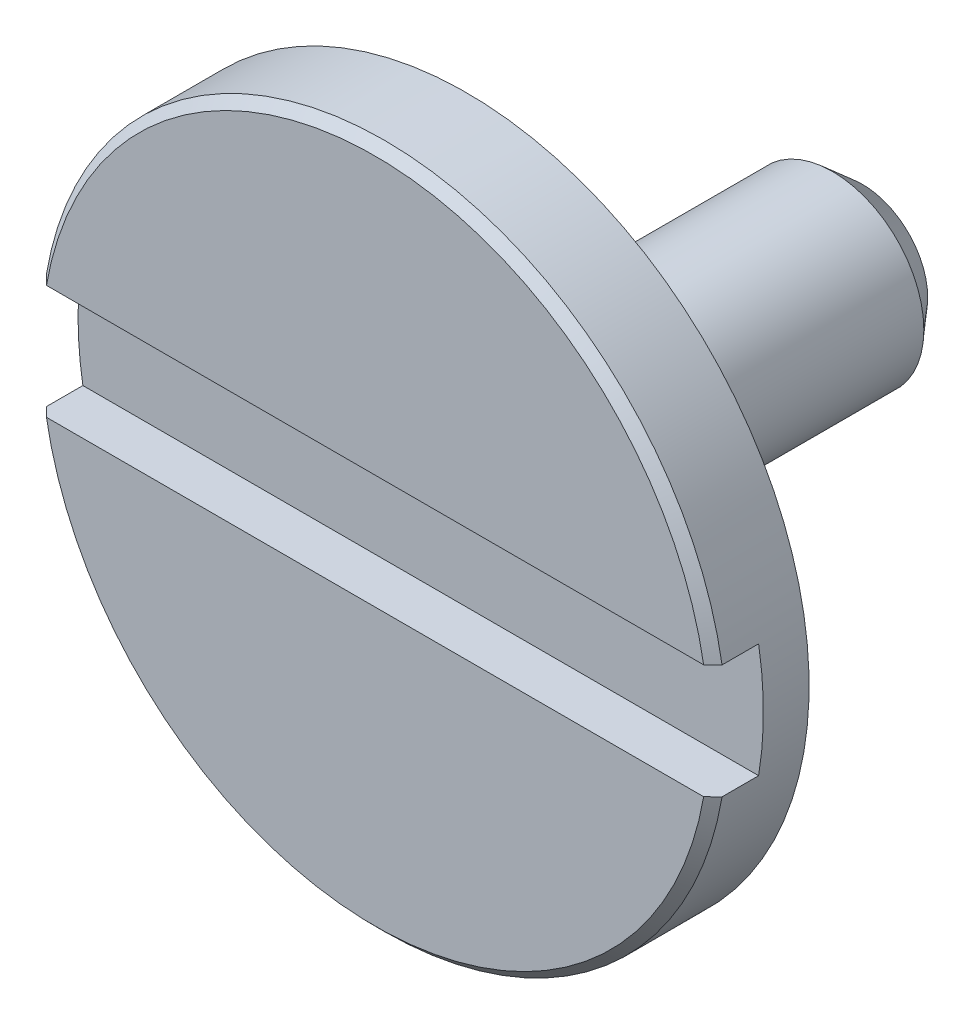
ISO-10303-21;
HEADER;
FILE_DESCRIPTION(('STEP AP214'),'2;1');
FILE_NAME('part.step','',(''),(''),'','','');
FILE_SCHEMA(('AUTOMOTIVE_DESIGN { 1 0 10303 214 1 1 1 1 }'));
ENDSEC;
DATA;
#1=APPLICATION_CONTEXT('core data for automotive mechanical design processes');
#2=APPLICATION_PROTOCOL_DEFINITION('international standard','automotive_design',2000,#1);
#3=PRODUCT_CONTEXT('',#1,'mechanical');
#4=PRODUCT('Part','Part','',(#3));
#5=PRODUCT_RELATED_PRODUCT_CATEGORY('part','',(#4));
#6=PRODUCT_DEFINITION_FORMATION('','',#4);
#7=PRODUCT_DEFINITION_CONTEXT('part definition',#1,'design');
#8=PRODUCT_DEFINITION('design','',#6,#7);
#9=PRODUCT_DEFINITION_SHAPE('','',#8);
#10=(LENGTH_UNIT() NAMED_UNIT(*) SI_UNIT(.MILLI.,.METRE.));
#11=(NAMED_UNIT(*) PLANE_ANGLE_UNIT() SI_UNIT($,.RADIAN.));
#12=(NAMED_UNIT(*) SI_UNIT($,.STERADIAN.) SOLID_ANGLE_UNIT());
#13=UNCERTAINTY_MEASURE_WITH_UNIT(LENGTH_MEASURE(1.E-05),#10,'distance_accuracy_value','');
#14=(GEOMETRIC_REPRESENTATION_CONTEXT(3) GLOBAL_UNCERTAINTY_ASSIGNED_CONTEXT((#13)) GLOBAL_UNIT_ASSIGNED_CONTEXT((#10,
#11,#12)) REPRESENTATION_CONTEXT('',''));
#15=CARTESIAN_POINT('',(0.,0.,0.));
#16=DIRECTION('',(0.,0.,1.));
#17=DIRECTION('',(1.,0.,0.));
#18=AXIS2_PLACEMENT_3D('',#15,#16,#17);
#19=CARTESIAN_POINT('',(-32.1280399999999,18.1449999999788,14.9608354648813));
#20=DIRECTION('',(0.,0.,-1.));
#21=DIRECTION('',(-1.,0.,0.));
#22=AXIS2_PLACEMENT_3D('',#19,#20,#21);
#23=PLANE('',#22);
#24=DIRECTION('',(1.,0.,0.));
#25=VECTOR('',#24,1.);
#26=CARTESIAN_POINT('',(-33.9799999999999,18.1449999999788,14.9608354648813));
#27=LINE('',#26,#25);
#28=CARTESIAN_POINT('',(-35.7844043338606,18.1449999999788,14.9608354649789));
#29=VERTEX_POINT('',#28);
#30=CARTESIAN_POINT('',(-32.1755956661392,18.1449999999788,14.9608354649789));
#31=VERTEX_POINT('',#30);
#32=EDGE_CURVE('E91',#29,#31,#27,.T.);
#33=ORIENTED_EDGE('',*,*,#32,.T.);
#34=CARTESIAN_POINT('',(-33.9799999999999,18.4499999999788,14.9608354650765));
#35=DIRECTION('',(0.,0.,-1.));
#36=DIRECTION('',(-1.,0.,0.));
#37=AXIS2_PLACEMENT_3D('',#34,#35,#36);
#38=CIRCLE('',#37,1.83);
#39=CARTESIAN_POINT('',(-32.1755956661392,18.7549999999788,14.9608354649789));
#40=VERTEX_POINT('',#39);
#41=EDGE_CURVE('E38',#40,#31,#38,.T.);
#42=ORIENTED_EDGE('',*,*,#41,.F.);
#43=DIRECTION('',(-1.,0.,0.));
#44=VECTOR('',#43,1.);
#45=CARTESIAN_POINT('',(-33.9799999999999,18.7549999999788,14.9608354648813));
#46=LINE('',#45,#44);
#47=CARTESIAN_POINT('',(-35.7844043338606,18.7549999999788,14.9608354649789));
#48=VERTEX_POINT('',#47);
#49=EDGE_CURVE('E88',#40,#48,#46,.T.);
#50=ORIENTED_EDGE('',*,*,#49,.T.);
#51=CARTESIAN_POINT('',(-33.9799999999999,18.4499999999788,14.9608354650765));
#52=DIRECTION('',(0.,0.,-1.));
#53=DIRECTION('',(-1.,0.,0.));
#54=AXIS2_PLACEMENT_3D('',#51,#52,#53);
#55=CIRCLE('',#54,1.83);
#56=EDGE_CURVE('E94',#29,#48,#55,.T.);
#57=ORIENTED_EDGE('',*,*,#56,.F.);
#58=EDGE_LOOP('',(#33,#42,#50,#57));
#59=FACE_BOUND('',#58,.T.);
#60=ADVANCED_FACE('F34',(#59),#23,.F.);
#61=CARTESIAN_POINT('',(-35.7844043338759,18.7549999999788,14.9608354648813));
#62=DIRECTION('',(0.,1.,0.));
#63=DIRECTION('',(0.,0.,1.));
#64=AXIS2_PLACEMENT_3D('',#61,#62,#63);
#65=PLANE('',#64);
#66=DIRECTION('',(0.,0.,-1.));
#67=VECTOR('',#66,1.);
#68=CARTESIAN_POINT('',(-32.1755956661239,18.7549999999788,15.0828354648813));
#69=LINE('',#68,#67);
#70=CARTESIAN_POINT('',(-32.1755956661357,18.7549999999788,15.1560354648779));
#71=VERTEX_POINT('',#70);
#72=EDGE_CURVE('E97',#71,#40,#69,.T.);
#73=ORIENTED_EDGE('',*,*,#72,.F.);
#74=CARTESIAN_POINT('',(-32.2251072857969,18.7549999999788,15.204835465341));
#75=CARTESIAN_POINT('',(-32.2168537349249,18.7549999999788,15.1967037697313));
#76=CARTESIAN_POINT('',(-32.2086009911842,18.7549999999788,15.1885712552204));
#77=CARTESIAN_POINT('',(-32.1920971179678,18.7549999999788,15.1723045883982));
#78=CARTESIAN_POINT('',(-32.183845988492,18.7549999999788,15.164170436087));
#79=CARTESIAN_POINT('',(-32.1755956661475,18.7549999999788,15.1560354648745));
#80=B_SPLINE_CURVE_WITH_KNOTS('',3,(#74,#75,#76,#77,#78,#79),.UNSPECIFIED.,.F.,.F.,(4,2,4),(0.,
0.0347593173649959,0.0695186347207362),.UNSPECIFIED.);
#81=CARTESIAN_POINT('',(-32.2251072855637,18.7549999999788,15.2048354651112));
#82=VERTEX_POINT('',#81);
#83=EDGE_CURVE('E104',#82,#71,#80,.T.);
#84=ORIENTED_EDGE('',*,*,#83,.F.);
#85=DIRECTION('',(1.,0.,0.));
#86=VECTOR('',#85,1.);
#87=CARTESIAN_POINT('',(-33.9799999999999,18.7549999999788,15.2048354648813));
#88=LINE('',#87,#86);
#89=CARTESIAN_POINT('',(-35.7348927144297,18.7549999999788,15.2048354651174));
#90=VERTEX_POINT('',#89);
#91=EDGE_CURVE('E193',#90,#82,#88,.T.);
#92=ORIENTED_EDGE('',*,*,#91,.F.);
#93=CARTESIAN_POINT('',(-35.7844043338376,18.7549999999342,15.1560354648333));
#94=CARTESIAN_POINT('',(-35.7761540115027,18.7549999999565,15.1641704360641));
#95=CARTESIAN_POINT('',(-35.7679028820319,18.7549999999713,15.172304588389));
#96=CARTESIAN_POINT('',(-35.7513990088161,18.7549999999862,15.188571255229));
#97=CARTESIAN_POINT('',(-35.7431462650711,18.7549999999862,15.1967037697442));
#98=CARTESIAN_POINT('',(-35.7348927141901,18.7549999999788,15.2048354653535));
#99=B_SPLINE_CURVE_WITH_KNOTS('',3,(#93,#94,#95,#96,#97,#98),.UNSPECIFIED.,.F.,.F.,(4,2,4),(0.,
0.0347593173738836,0.0695186347570097),.UNSPECIFIED.);
#100=CARTESIAN_POINT('',(-35.7844043338606,18.7549999999788,15.1560354648662));
#101=VERTEX_POINT('',#100);
#102=EDGE_CURVE('E116',#101,#90,#99,.T.);
#103=ORIENTED_EDGE('',*,*,#102,.F.);
#104=DIRECTION('',(0.,0.,1.));
#105=VECTOR('',#104,1.);
#106=CARTESIAN_POINT('',(-35.7844043338759,18.7549999999788,15.0828354648813));
#107=LINE('',#106,#105);
#108=EDGE_CURVE('E108',#48,#101,#107,.T.);
#109=ORIENTED_EDGE('',*,*,#108,.F.);
#110=ORIENTED_EDGE('',*,*,#49,.F.);
#111=EDGE_LOOP('',(#73,#84,#92,#103,#109,#110));
#112=FACE_BOUND('',#111,.T.);
#113=ADVANCED_FACE('F106',(#112),#65,.F.);
#114=CARTESIAN_POINT('',(-35.7844043338759,18.1449999999788,15.2048354648813));
#115=DIRECTION('',(0.,-1.,0.));
#116=DIRECTION('',(0.,0.,-1.));
#117=AXIS2_PLACEMENT_3D('',#114,#115,#116);
#118=PLANE('',#117);
#119=DIRECTION('',(0.,0.,-1.));
#120=VECTOR('',#119,1.);
#121=CARTESIAN_POINT('',(-35.7844043338759,18.1449999999788,15.0828354648813));
#122=LINE('',#121,#120);
#123=CARTESIAN_POINT('',(-35.7844043338667,18.1449999999788,15.1560354648753));
#124=VERTEX_POINT('',#123);
#125=EDGE_CURVE('E138',#124,#29,#122,.T.);
#126=ORIENTED_EDGE('',*,*,#125,.F.);
#127=CARTESIAN_POINT('',(-35.7348927140778,18.1450000001504,15.2048354652507));
#128=CARTESIAN_POINT('',(-35.7431462650071,18.1450000000646,15.1967037696913));
#129=CARTESIAN_POINT('',(-35.7513990087873,18.1450000000074,15.1885712552126));
#130=CARTESIAN_POINT('',(-35.7679028820472,18.1449999999502,15.1723045884188));
#131=CARTESIAN_POINT('',(-35.7761540115269,18.1449999999502,15.1641704361037));
#132=CARTESIAN_POINT('',(-35.7844043338575,18.1449999999788,15.1560354648693));
#133=B_SPLINE_CURVE_WITH_KNOTS('',3,(#127,#128,#129,#130,#131,#132),.UNSPECIFIED.,.F.,.F.,(4,2,
4),(0.,0.0347593173815172,0.0695186347537757),.UNSPECIFIED.);
#134=CARTESIAN_POINT('',(-35.7348927144269,18.1449999999788,15.2048354651202));
#135=VERTEX_POINT('',#134);
#136=EDGE_CURVE('E53',#135,#124,#133,.T.);
#137=ORIENTED_EDGE('',*,*,#136,.F.);
#138=DIRECTION('',(-1.,0.,0.));
#139=VECTOR('',#138,1.);
#140=CARTESIAN_POINT('',(-33.9799999999999,18.1449999999788,15.2048354648813));
#141=LINE('',#140,#139);
#142=CARTESIAN_POINT('',(-32.2251072855764,18.1449999999788,15.2048354651237));
#143=VERTEX_POINT('',#142);
#144=EDGE_CURVE('E131',#143,#135,#141,.T.);
#145=ORIENTED_EDGE('',*,*,#144,.F.);
#146=CARTESIAN_POINT('',(-32.1755956661502,18.1449999999788,15.1560354648771));
#147=CARTESIAN_POINT('',(-32.1838459884984,18.1449999999788,15.1641704360933));
#148=CARTESIAN_POINT('',(-32.192097117978,18.1449999999788,15.1723045884083));
#149=CARTESIAN_POINT('',(-32.208600991202,18.1449999999788,15.1885712552379));
#150=CARTESIAN_POINT('',(-32.2168537349465,18.1449999999788,15.1967037697526));
#151=CARTESIAN_POINT('',(-32.2251072858223,18.1449999999788,15.204835465366));
#152=B_SPLINE_CURVE_WITH_KNOTS('',3,(#146,#147,#148,#149,#150,#151),.UNSPECIFIED.,.F.,.F.,(4,2,
4),(0.,0.0347593173716686,0.0695186347525891),.UNSPECIFIED.);
#153=CARTESIAN_POINT('',(-32.1755956661392,18.1449999999788,15.1560354648662));
#154=VERTEX_POINT('',#153);
#155=EDGE_CURVE('E111',#154,#143,#152,.T.);
#156=ORIENTED_EDGE('',*,*,#155,.F.);
#157=DIRECTION('',(0.,0.,1.));
#158=VECTOR('',#157,1.);
#159=CARTESIAN_POINT('',(-32.1755956661239,18.1449999999788,15.0828354648813));
#160=LINE('',#159,#158);
#161=EDGE_CURVE('E109',#31,#154,#160,.T.);
#162=ORIENTED_EDGE('',*,*,#161,.F.);
#163=ORIENTED_EDGE('',*,*,#32,.F.);
#164=EDGE_LOOP('',(#126,#137,#145,#156,#162,#163));
#165=FACE_BOUND('',#164,.T.);
#166=ADVANCED_FACE('F147',(#165),#118,.F.);
#167=CARTESIAN_POINT('',(-35.7559514272639,18.7549999999788,15.2048354648813));
#168=DIRECTION('',(0.,0.,1.));
#169=DIRECTION('',(1.,0.,0.));
#170=AXIS2_PLACEMENT_3D('',#167,#168,#169);
#171=PLANE('',#170);
#172=ORIENTED_EDGE('',*,*,#91,.T.);
#173=CARTESIAN_POINT('',(-33.9799999999999,18.4499999999788,15.2048354648813));
#174=DIRECTION('',(0.,0.,-1.));
#175=DIRECTION('',(-1.,0.,0.));
#176=AXIS2_PLACEMENT_3D('',#173,#174,#175);
#177=CIRCLE('',#176,1.7812);
#178=EDGE_CURVE('E128',#82,#90,#177,.F.);
#179=ORIENTED_EDGE('',*,*,#178,.T.);
#180=EDGE_LOOP('',(#172,#179));
#181=FACE_BOUND('',#180,.T.);
#182=ADVANCED_FACE('F152',(#181),#171,.T.);
#183=CARTESIAN_POINT('',(-35.7559514272639,16.6599427999788,15.2048354648813));
#184=DIRECTION('',(0.,0.,1.));
#185=DIRECTION('',(1.,0.,0.));
#186=AXIS2_PLACEMENT_3D('',#183,#184,#185);
#187=PLANE('',#186);
#188=ORIENTED_EDGE('',*,*,#144,.T.);
#189=CARTESIAN_POINT('',(-33.9799999999999,18.4499999999788,15.2048354648813));
#190=DIRECTION('',(0.,0.,-1.));
#191=DIRECTION('',(-1.,0.,0.));
#192=AXIS2_PLACEMENT_3D('',#189,#190,#191);
#193=CIRCLE('',#192,1.7812);
#194=EDGE_CURVE('E118',#135,#143,#193,.F.);
#195=ORIENTED_EDGE('',*,*,#194,.T.);
#196=EDGE_LOOP('',(#188,#195));
#197=FACE_BOUND('',#196,.T.);
#198=ADVANCED_FACE('F158',(#197),#187,.T.);
#199=CARTESIAN_POINT('',(-33.9799999999999,18.4499999999788,15.2048354648813));
#200=DIRECTION('',(0.,0.,-1.));
#201=DIRECTION('',(-1.,0.,0.));
#202=AXIS2_PLACEMENT_3D('',#199,#200,#201);
#203=CONICAL_SURFACE('',#202,1.7812,0.785398163397431);
#204=ORIENTED_EDGE('',*,*,#83,.T.);
#205=CARTESIAN_POINT('',(-33.9799999999999,18.4499999999788,15.1560354648813));
#206=DIRECTION('',(0.,0.,-1.));
#207=DIRECTION('',(-1.,0.,0.));
#208=AXIS2_PLACEMENT_3D('',#205,#206,#207);
#209=CIRCLE('',#208,1.83);
#210=EDGE_CURVE('E102',#71,#101,#209,.F.);
#211=ORIENTED_EDGE('',*,*,#210,.T.);
#212=ORIENTED_EDGE('',*,*,#102,.T.);
#213=ORIENTED_EDGE('',*,*,#178,.F.);
#214=EDGE_LOOP('',(#204,#211,#212,#213));
#215=FACE_BOUND('',#214,.T.);
#216=ADVANCED_FACE('F161',(#215),#203,.T.);
#217=CARTESIAN_POINT('',(-33.9799999999999,18.4499999999788,15.2048354648813));
#218=DIRECTION('',(0.,0.,-1.));
#219=DIRECTION('',(-1.,0.,0.));
#220=AXIS2_PLACEMENT_3D('',#217,#218,#219);
#221=CONICAL_SURFACE('',#220,1.7812,0.785398163397431);
#222=ORIENTED_EDGE('',*,*,#136,.T.);
#223=CARTESIAN_POINT('',(-33.9799999999999,18.4499999999788,15.1560354648813));
#224=DIRECTION('',(0.,0.,-1.));
#225=DIRECTION('',(-1.,0.,0.));
#226=AXIS2_PLACEMENT_3D('',#223,#224,#225);
#227=CIRCLE('',#226,1.83);
#228=EDGE_CURVE('E117',#124,#154,#227,.F.);
#229=ORIENTED_EDGE('',*,*,#228,.T.);
#230=ORIENTED_EDGE('',*,*,#155,.T.);
#231=ORIENTED_EDGE('',*,*,#194,.F.);
#232=EDGE_LOOP('',(#222,#229,#230,#231));
#233=FACE_BOUND('',#232,.T.);
#234=ADVANCED_FACE('F143',(#233),#221,.T.);
#235=CARTESIAN_POINT('',(-33.6269385106519,18.0969385106308,12.6024211963693));
#236=DIRECTION('',(0.,0.,-1.));
#237=DIRECTION('',(-1.,0.,0.));
#238=AXIS2_PLACEMENT_3D('',#235,#236,#237);
#239=PLANE('',#238);
#240=CARTESIAN_POINT('',(-33.9799999999999,18.4499999999788,12.6024211963693));
#241=DIRECTION('',(0.,0.,1.));
#242=DIRECTION('',(1.,0.,0.));
#243=AXIS2_PLACEMENT_3D('',#240,#241,#242);
#244=CIRCLE('',#243,0.348874989564005);
#245=CARTESIAN_POINT('',(-33.6311250104359,18.4499999999788,12.6024211963693));
#246=VERTEX_POINT('',#245);
#247=EDGE_CURVE('E123',#246,#246,#244,.F.);
#248=ORIENTED_EDGE('',*,*,#247,.T.);
#249=EDGE_LOOP('',(#248));
#250=FACE_BOUND('',#249,.T.);
#251=ADVANCED_FACE('F163',(#250),#239,.T.);
#252=CARTESIAN_POINT('',(-33.9799999999999,18.4499999999788,15.1560354648813));
#253=DIRECTION('',(0.,0.,-1.));
#254=DIRECTION('',(-1.,0.,0.));
#255=AXIS2_PLACEMENT_3D('',#252,#253,#254);
#256=CYLINDRICAL_SURFACE('',#255,1.83);
#257=ORIENTED_EDGE('',*,*,#56,.T.);
#258=ORIENTED_EDGE('',*,*,#108,.T.);
#259=ORIENTED_EDGE('',*,*,#210,.F.);
#260=ORIENTED_EDGE('',*,*,#72,.T.);
#261=ORIENTED_EDGE('',*,*,#41,.T.);
#262=ORIENTED_EDGE('',*,*,#161,.T.);
#263=ORIENTED_EDGE('',*,*,#228,.F.);
#264=ORIENTED_EDGE('',*,*,#125,.T.);
#265=EDGE_LOOP('',(#257,#258,#259,#260,#261,#262,#263,#264));
#266=FACE_BOUND('',#265,.T.);
#267=CARTESIAN_POINT('',(-33.9799999999999,18.4499999999788,14.7168354648813));
#268=DIRECTION('',(0.,0.,-1.));
#269=DIRECTION('',(-1.,0.,0.));
#270=AXIS2_PLACEMENT_3D('',#267,#268,#269);
#271=CIRCLE('',#270,1.83);
#272=CARTESIAN_POINT('',(-35.8099999999999,18.4499999999788,14.7168354648813));
#273=VERTEX_POINT('',#272);
#274=EDGE_CURVE('E120',#273,#273,#271,.T.);
#275=ORIENTED_EDGE('',*,*,#274,.F.);
#276=EDGE_LOOP('',(#275));
#277=FACE_BOUND('',#276,.T.);
#278=ADVANCED_FACE('F99',(#266,#277),#256,.T.);
#279=CARTESIAN_POINT('',(-33.9799999999999,18.4499999999788,12.6024211963693));
#280=DIRECTION('',(0.,0.,1.));
#281=DIRECTION('',(1.,0.,0.));
#282=AXIS2_PLACEMENT_3D('',#279,#280,#281);
#283=CONICAL_SURFACE('',#282,0.348874989564,0.716567521051918);
#284=CARTESIAN_POINT('',(-33.9799999999999,18.4499999999788,12.7621489834013));
#285=DIRECTION('',(0.,0.,-1.));
#286=DIRECTION('',(-1.,0.,0.));
#287=AXIS2_PLACEMENT_3D('',#284,#285,#286);
#288=CIRCLE('',#287,0.488);
#289=CARTESIAN_POINT('',(-34.4679999999999,18.4499999999788,12.7621489834013));
#290=VERTEX_POINT('',#289);
#291=EDGE_CURVE('E44',#290,#290,#288,.T.);
#292=ORIENTED_EDGE('',*,*,#291,.T.);
#293=EDGE_LOOP('',(#292));
#294=FACE_BOUND('',#293,.T.);
#295=ORIENTED_EDGE('',*,*,#247,.F.);
#296=EDGE_LOOP('',(#295));
#297=FACE_BOUND('',#296,.T.);
#298=ADVANCED_FACE('F170',(#294,#297),#283,.T.);
#299=CARTESIAN_POINT('',(-32.1280399999999,16.5980399999788,14.7168354648813));
#300=DIRECTION('',(0.,0.,-1.));
#301=DIRECTION('',(-1.,0.,0.));
#302=AXIS2_PLACEMENT_3D('',#299,#300,#301);
#303=PLANE('',#302);
#304=CARTESIAN_POINT('',(-33.9799999999999,18.4499999999788,14.7168354648813));
#305=DIRECTION('',(0.,0.,-1.));
#306=DIRECTION('',(0.,1.,0.));
#307=AXIS2_PLACEMENT_3D('',#304,#305,#306);
#308=CIRCLE('',#307,0.488);
#309=CARTESIAN_POINT('',(-33.9799999999999,18.9379999999788,14.7168354648813));
#310=VERTEX_POINT('',#309);
#311=EDGE_CURVE('E11',#310,#310,#308,.F.);
#312=ORIENTED_EDGE('',*,*,#311,.T.);
#313=EDGE_LOOP('',(#312));
#314=FACE_BOUND('',#313,.T.);
#315=ORIENTED_EDGE('',*,*,#274,.T.);
#316=EDGE_LOOP('',(#315));
#317=FACE_BOUND('',#316,.T.);
#318=ADVANCED_FACE('F36',(#314,#317),#303,.T.);
#319=CARTESIAN_POINT('',(-33.9799999999999,18.4499999999788,14.7168354648813));
#320=DIRECTION('',(0.,0.,-1.));
#321=DIRECTION('',(0.,1.,0.));
#322=AXIS2_PLACEMENT_3D('',#319,#320,#321);
#323=CYLINDRICAL_SURFACE('',#322,0.488);
#324=ORIENTED_EDGE('',*,*,#291,.F.);
#325=EDGE_LOOP('',(#324));
#326=FACE_BOUND('',#325,.T.);
#327=ORIENTED_EDGE('',*,*,#311,.F.);
#328=EDGE_LOOP('',(#327));
#329=FACE_BOUND('',#328,.T.);
#330=ADVANCED_FACE('F172',(#326,#329),#323,.T.);
#331=CLOSED_SHELL('',(#60,#113,#166,#182,#198,#216,#234,#251,#278,#298,#318,#330));
#332=MANIFOLD_SOLID_BREP('B2',#331);
#333=ADVANCED_BREP_SHAPE_REPRESENTATION('',(#18,#332),#14);
#334=SHAPE_DEFINITION_REPRESENTATION(#9,#333);
ENDSEC;
END-ISO-10303-21;
